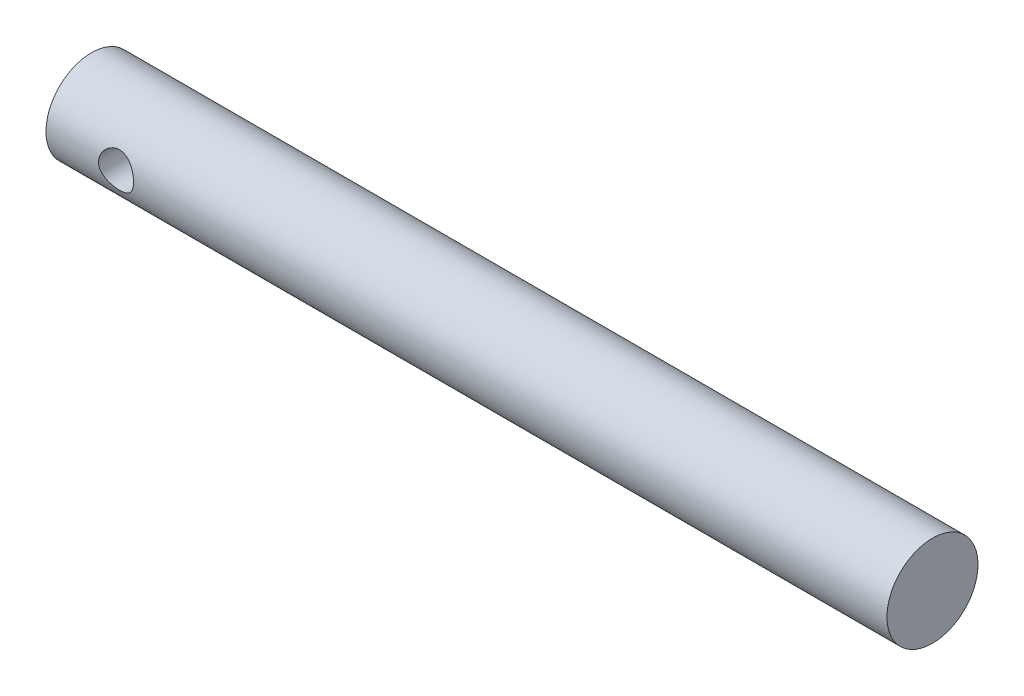
ISO-10303-21;
HEADER;
FILE_DESCRIPTION(('STEP AP214'),'2;1');
FILE_NAME('part.step','',(''),(''),'','','');
FILE_SCHEMA(('AUTOMOTIVE_DESIGN { 1 0 10303 214 1 1 1 1 }'));
ENDSEC;
DATA;
#1=APPLICATION_CONTEXT('core data for automotive mechanical design processes');
#2=APPLICATION_PROTOCOL_DEFINITION('international standard','automotive_design',2000,#1);
#3=PRODUCT_CONTEXT('',#1,'mechanical');
#4=PRODUCT('Part','Part','',(#3));
#5=PRODUCT_RELATED_PRODUCT_CATEGORY('part','',(#4));
#6=PRODUCT_DEFINITION_FORMATION('','',#4);
#7=PRODUCT_DEFINITION_CONTEXT('part definition',#1,'design');
#8=PRODUCT_DEFINITION('design','',#6,#7);
#9=PRODUCT_DEFINITION_SHAPE('','',#8);
#10=(LENGTH_UNIT() NAMED_UNIT(*) SI_UNIT(.MILLI.,.METRE.));
#11=(NAMED_UNIT(*) PLANE_ANGLE_UNIT() SI_UNIT($,.RADIAN.));
#12=(NAMED_UNIT(*) SI_UNIT($,.STERADIAN.) SOLID_ANGLE_UNIT());
#13=UNCERTAINTY_MEASURE_WITH_UNIT(LENGTH_MEASURE(1.E-05),#10,'distance_accuracy_value','');
#14=(GEOMETRIC_REPRESENTATION_CONTEXT(3) GLOBAL_UNCERTAINTY_ASSIGNED_CONTEXT((#13)) GLOBAL_UNIT_ASSIGNED_CONTEXT((#10,
#11,#12)) REPRESENTATION_CONTEXT('',''));
#15=CARTESIAN_POINT('',(0.,0.,0.));
#16=DIRECTION('',(0.,0.,1.));
#17=DIRECTION('',(1.,0.,0.));
#18=AXIS2_PLACEMENT_3D('',#15,#16,#17);
#19=CARTESIAN_POINT('',(-18.,0.,0.));
#20=DIRECTION('',(-1.,0.,0.));
#21=DIRECTION('',(0.,-1.,0.));
#22=AXIS2_PLACEMENT_3D('',#19,#20,#21);
#23=PLANE('',#22);
#24=CARTESIAN_POINT('',(-18.,0.,0.));
#25=DIRECTION('',(-1.,0.,0.));
#26=DIRECTION('',(0.,-1.,0.));
#27=AXIS2_PLACEMENT_3D('',#24,#25,#26);
#28=CIRCLE('',#27,1.95);
#29=CARTESIAN_POINT('',(-18.,-1.95,0.));
#30=VERTEX_POINT('',#29);
#31=EDGE_CURVE('E10',#30,#30,#28,.T.);
#32=ORIENTED_EDGE('',*,*,#31,.T.);
#33=EDGE_LOOP('',(#32));
#34=FACE_BOUND('',#33,.T.);
#35=ADVANCED_FACE('F39',(#34),#23,.T.);
#36=CARTESIAN_POINT('',(-18.,0.,0.));
#37=DIRECTION('',(-1.,0.,0.));
#38=DIRECTION('',(0.,-1.,0.));
#39=AXIS2_PLACEMENT_3D('',#36,#37,#38);
#40=CYLINDRICAL_SURFACE('',#39,1.95);
#41=CARTESIAN_POINT('',(-14.25,0.,-1.95));
#42=CARTESIAN_POINT('',(-14.2499981782097,-0.0405429191923411,-1.9500013889589));
#43=CARTESIAN_POINT('',(-14.2532976030997,-0.0810737051070533,-1.94872476548912));
#44=CARTESIAN_POINT('',(-14.2663514039077,-0.160919968102906,-1.94376018150422));
#45=CARTESIAN_POINT('',(-14.2761044877655,-0.200235686798799,-1.94007270365798));
#46=CARTESIAN_POINT('',(-14.3016669279473,-0.27648840096756,-1.93068098797991));
#47=CARTESIAN_POINT('',(-14.3174642320862,-0.313429960395832,-1.9249807652981));
#48=CARTESIAN_POINT('',(-14.3546037260167,-0.384134726703963,-1.91212797807933));
#49=CARTESIAN_POINT('',(-14.3759474807601,-0.417897032876909,-1.90497500376771));
#50=CARTESIAN_POINT('',(-14.4245608714511,-0.482781776023632,-1.88959736394845));
#51=CARTESIAN_POINT('',(-14.4520332184991,-0.513744818913309,-1.88134129617782));
#52=CARTESIAN_POINT('',(-14.5116936266424,-0.570754120237587,-1.86483836479127));
#53=CARTESIAN_POINT('',(-14.5438832359471,-0.596798758000071,-1.85659150509628));
#54=CARTESIAN_POINT('',(-14.6136524937566,-0.644272025035922,-1.84067024000969));
#55=CARTESIAN_POINT('',(-14.651397638578,-0.665470989304325,-1.83303254536538));
#56=CARTESIAN_POINT('',(-14.7302569979466,-0.701148567532011,-1.81968575562311));
#57=CARTESIAN_POINT('',(-14.7713697784423,-0.715630024704995,-1.81397584486139));
#58=CARTESIAN_POINT('',(-14.8539590208678,-0.73682478870611,-1.80546819243754));
#59=CARTESIAN_POINT('',(-14.8953449859923,-0.743843403602975,-1.80255650754391));
#60=CARTESIAN_POINT('',(-14.9788018379931,-0.75086759842558,-1.79964268449158));
#61=CARTESIAN_POINT('',(-15.020872414606,-0.750876271327548,-1.79963926312822));
#62=CARTESIAN_POINT('',(-15.1016592774455,-0.74411296893883,-1.80244451272089));
#63=CARTESIAN_POINT('',(-15.1404189638744,-0.737771387119336,-1.80507468879926));
#64=CARTESIAN_POINT('',(-15.216274523822,-0.719201418400302,-1.81255302114849));
#65=CARTESIAN_POINT('',(-15.2533701322616,-0.706972097228779,-1.81740152942031));
#66=CARTESIAN_POINT('',(-15.3256974935347,-0.676747991768704,-1.82887311050732));
#67=CARTESIAN_POINT('',(-15.3608787456651,-0.65864535142996,-1.83552896758488));
#68=CARTESIAN_POINT('',(-15.4278263635505,-0.61726383480847,-1.84985510301363));
#69=CARTESIAN_POINT('',(-15.4595915022369,-0.593983107707848,-1.85752574368349));
#70=CARTESIAN_POINT('',(-15.5211777483737,-0.540961545998799,-1.87368103554139));
#71=CARTESIAN_POINT('',(-15.550700765883,-0.51087943334821,-1.88218481651937));
#72=CARTESIAN_POINT('',(-15.604374200785,-0.44609591713673,-1.89858206047745));
#73=CARTESIAN_POINT('',(-15.6285237045002,-0.411393729608995,-1.9064754195167));
#74=CARTESIAN_POINT('',(-15.6711165144645,-0.337562732265242,-1.92093422019693));
#75=CARTESIAN_POINT('',(-15.689455697278,-0.298368629746978,-1.92747477209834));
#76=CARTESIAN_POINT('',(-15.7191798307647,-0.217136899924052,-1.938305104308));
#77=CARTESIAN_POINT('',(-15.7305680373392,-0.17510061418949,-1.94259593827185));
#78=CARTESIAN_POINT('',(-15.7454826545287,-0.0918827622127077,-1.94825556937513));
#79=CARTESIAN_POINT('',(-15.7494101636875,-0.0507831531761167,-1.9497732661453));
#80=CARTESIAN_POINT('',(-15.750466031411,0.0315114168209008,-1.95017911828569));
#81=CARTESIAN_POINT('',(-15.7475959916316,0.0727063530351842,-1.94906789308931));
#82=CARTESIAN_POINT('',(-15.7354394746979,0.152257017445377,-1.94443875795888));
#83=CARTESIAN_POINT('',(-15.7264199081906,0.190659983589788,-1.94102101913293));
#84=CARTESIAN_POINT('',(-15.7025762308496,0.265377333725863,-1.93222438564929));
#85=CARTESIAN_POINT('',(-15.6877513672287,0.301691446150019,-1.92684523665693));
#86=CARTESIAN_POINT('',(-15.65223971543,0.372419288182055,-1.91445348861844));
#87=CARTESIAN_POINT('',(-15.6313908556867,0.406743687293187,-1.90739684429773));
#88=CARTESIAN_POINT('',(-15.5846048615618,0.471524162838171,-1.89242493900216));
#89=CARTESIAN_POINT('',(-15.558665782813,0.501978753731921,-1.88450935044501));
#90=CARTESIAN_POINT('',(-15.500574074795,0.560102599037685,-1.86808794698959));
#91=CARTESIAN_POINT('',(-15.4681387383092,0.587488199711815,-1.85957560686036));
#92=CARTESIAN_POINT('',(-15.3989713792074,0.636488942269692,-1.84337996356592));
#93=CARTESIAN_POINT('',(-15.3622388585389,0.658103414313084,-1.83569675669773));
#94=CARTESIAN_POINT('',(-15.2851271857809,0.69501049765783,-1.8220460966134));
#95=CARTESIAN_POINT('',(-15.2447271482296,0.710263725217771,-1.81608939981491));
#96=CARTESIAN_POINT('',(-15.161636818349,0.733643588359655,-1.80677295827016));
#97=CARTESIAN_POINT('',(-15.118948064502,0.741774949094469,-1.80341149183927));
#98=CARTESIAN_POINT('',(-15.0355834197395,0.75024663159884,-1.79990250805838));
#99=CARTESIAN_POINT('',(-14.9949650942791,0.751073888829789,-1.79955415294045));
#100=CARTESIAN_POINT('',(-14.9141996722696,0.746173238556251,-1.80159164243551));
#101=CARTESIAN_POINT('',(-14.8740525264637,0.740446022530951,-1.8039771986283));
#102=CARTESIAN_POINT('',(-14.7967511811592,0.722985410225056,-1.81104267682804));
#103=CARTESIAN_POINT('',(-14.7595416893064,0.711461485190331,-1.81564235489165));
#104=CARTESIAN_POINT('',(-14.6875650619622,0.682923345478795,-1.82656726894715));
#105=CARTESIAN_POINT('',(-14.6527985612545,0.665907710219587,-1.83289295135217));
#106=CARTESIAN_POINT('',(-14.5846394089277,0.625797958515307,-1.84698443494313));
#107=CARTESIAN_POINT('',(-14.5514240275573,0.602423818284046,-1.85480980698614));
#108=CARTESIAN_POINT('',(-14.4892320846273,0.550684721970976,-1.87082311830124));
#109=CARTESIAN_POINT('',(-14.4602569108256,0.522318138596515,-1.87901117513766));
#110=CARTESIAN_POINT('',(-14.4056473872093,0.459431490657048,-1.89539881550091));
#111=CARTESIAN_POINT('',(-14.3803049823181,0.424649648805944,-1.90357142425467));
#112=CARTESIAN_POINT('',(-14.3358267421072,0.351032148711189,-1.91851148284898));
#113=CARTESIAN_POINT('',(-14.3166919486528,0.312195811418455,-1.9252786967441));
#114=CARTESIAN_POINT('',(-14.2842886742944,0.228870252669729,-1.93700741831298));
#115=CARTESIAN_POINT('',(-14.2714846871835,0.184177511259415,-1.94182221166289));
#116=CARTESIAN_POINT('',(-14.2543438185226,0.0929838293532701,-1.94831680873259));
#117=CARTESIAN_POINT('',(-14.2500020887492,0.0464839398001029,-1.94999840750782));
#118=CARTESIAN_POINT('',(-14.25,0.,-1.95));
#119=B_SPLINE_CURVE_WITH_KNOTS('',3,(#41,#42,#43,#44,#45,#46,#47,#48,#49,#50,#51,#52,#53,#54,
#55,#56,#57,#58,#59,#60,#61,#62,#63,#64,#65,#66,#67,#68,#69,#70,#71,#72,#73,#74,#75,#76,#77,#78,
#79,#80,#81,#82,#83,#84,#85,#86,#87,#88,#89,#90,#91,#92,#93,#94,#95,#96,#97,#98,#99,#100,#101,
#102,#103,#104,#105,#106,#107,#108,#109,#110,#111,#112,#113,#114,#115,#116,#117,#118),
.UNSPECIFIED.,.T.,.F.,(4,2,2,2,2,2,2,2,2,2,2,2,2,2,2,2,2,2,2,2,2,2,2,2,2,2,2,2,2,2,2,2,2,2,2,2,
2,2,4),(0.,0.121457218701953,0.24289012831358,0.364082151895032,0.485308407455807,
0.611378709908598,0.737490481793604,0.8687097231382,0.999873374585367,1.12543609823519,
1.25094342018099,1.36848366926547,1.48604257589701,1.60589565334463,1.72579163925049,
1.85419904496568,1.98262826759134,2.11324351920223,2.24379754238027,2.36710883693884,
2.49039107946488,2.60863705924401,2.72689837735151,2.84869698288168,2.9705422040497,
3.09982797856256,3.22912875243276,3.35921857744994,3.48922202610224,3.61048734931736,
3.73173988054834,3.84889560575541,3.96608166084621,4.08963459462096,4.21322787545637,
4.34400255536972,4.47479917274035,4.61413416828711,4.75338931209274),.UNSPECIFIED.);
#120=CARTESIAN_POINT('',(-14.25,0.,-1.95));
#121=VERTEX_POINT('',#120);
#122=EDGE_CURVE('E51',#121,#121,#119,.T.);
#123=ORIENTED_EDGE('',*,*,#122,.F.);
#124=EDGE_LOOP('',(#123));
#125=FACE_BOUND('',#124,.T.);
#126=CARTESIAN_POINT('',(-14.25,0.,1.95));
#127=CARTESIAN_POINT('',(-14.2499981782097,0.0405429191923415,1.9500013889589));
#128=CARTESIAN_POINT('',(-14.2532976030997,0.0810737051070537,1.94872476548912));
#129=CARTESIAN_POINT('',(-14.2663514039077,0.160919968102907,1.94376018150422));
#130=CARTESIAN_POINT('',(-14.2761044877655,0.2002356867988,1.94007270365798));
#131=CARTESIAN_POINT('',(-14.3016669279473,0.276488400967561,1.93068098797991));
#132=CARTESIAN_POINT('',(-14.3174642320862,0.313429960395832,1.9249807652981));
#133=CARTESIAN_POINT('',(-14.3546037260167,0.384134726703963,1.91212797807933));
#134=CARTESIAN_POINT('',(-14.3759474807601,0.417897032876909,1.90497500376771));
#135=CARTESIAN_POINT('',(-14.4245608714511,0.482781776023632,1.88959736394845));
#136=CARTESIAN_POINT('',(-14.4520332184991,0.51374481891331,1.88134129617782));
#137=CARTESIAN_POINT('',(-14.5116936266424,0.570754120237587,1.86483836479127));
#138=CARTESIAN_POINT('',(-14.5438832359471,0.596798758000071,1.85659150509628));
#139=CARTESIAN_POINT('',(-14.6136524937566,0.644272025035922,1.84067024000969));
#140=CARTESIAN_POINT('',(-14.651397638578,0.665470989304324,1.83303254536538));
#141=CARTESIAN_POINT('',(-14.7302569979466,0.70114856753201,1.81968575562311));
#142=CARTESIAN_POINT('',(-14.7713697784423,0.715630024704995,1.81397584486139));
#143=CARTESIAN_POINT('',(-14.8539590208678,0.73682478870611,1.80546819243754));
#144=CARTESIAN_POINT('',(-14.8953449859923,0.743843403602975,1.80255650754391));
#145=CARTESIAN_POINT('',(-14.9788018379931,0.75086759842558,1.79964268449158));
#146=CARTESIAN_POINT('',(-15.020872414606,0.750876271327548,1.79963926312822));
#147=CARTESIAN_POINT('',(-15.1016592774455,0.74411296893883,1.80244451272089));
#148=CARTESIAN_POINT('',(-15.1404189638744,0.737771387119336,1.80507468879926));
#149=CARTESIAN_POINT('',(-15.216274523822,0.719201418400302,1.81255302114849));
#150=CARTESIAN_POINT('',(-15.2533701322616,0.706972097228779,1.81740152942031));
#151=CARTESIAN_POINT('',(-15.3256974935347,0.676747991768704,1.82887311050732));
#152=CARTESIAN_POINT('',(-15.3608787456651,0.65864535142996,1.83552896758488));
#153=CARTESIAN_POINT('',(-15.4278263635505,0.617263834808469,1.84985510301363));
#154=CARTESIAN_POINT('',(-15.4595915022369,0.593983107707847,1.85752574368349));
#155=CARTESIAN_POINT('',(-15.5211777483737,0.540961545998798,1.87368103554139));
#156=CARTESIAN_POINT('',(-15.550700765883,0.510879433348209,1.88218481651938));
#157=CARTESIAN_POINT('',(-15.604374200785,0.446095917136729,1.89858206047745));
#158=CARTESIAN_POINT('',(-15.6285237045002,0.411393729608994,1.9064754195167));
#159=CARTESIAN_POINT('',(-15.6711165144645,0.337562732265242,1.92093422019693));
#160=CARTESIAN_POINT('',(-15.689455697278,0.298368629746978,1.92747477209834));
#161=CARTESIAN_POINT('',(-15.7191798307647,0.217136899924051,1.938305104308));
#162=CARTESIAN_POINT('',(-15.7305680373392,0.175100614189488,1.94259593827185));
#163=CARTESIAN_POINT('',(-15.7454826545287,0.0918827622127061,1.94825556937513));
#164=CARTESIAN_POINT('',(-15.7494101636875,0.0507831531761153,1.9497732661453));
#165=CARTESIAN_POINT('',(-15.750466031411,-0.031511416820902,1.95017911828569));
#166=CARTESIAN_POINT('',(-15.7475959916316,-0.0727063530351853,1.94906789308931));
#167=CARTESIAN_POINT('',(-15.7354394746979,-0.152257017445378,1.94443875795888));
#168=CARTESIAN_POINT('',(-15.7264199081906,-0.190659983589789,1.94102101913293));
#169=CARTESIAN_POINT('',(-15.7025762308496,-0.265377333725864,1.93222438564929));
#170=CARTESIAN_POINT('',(-15.6877513672287,-0.30169144615002,1.92684523665693));
#171=CARTESIAN_POINT('',(-15.65223971543,-0.372419288182056,1.91445348861844));
#172=CARTESIAN_POINT('',(-15.6313908556867,-0.406743687293187,1.90739684429773));
#173=CARTESIAN_POINT('',(-15.5846048615618,-0.471524162838172,1.89242493900216));
#174=CARTESIAN_POINT('',(-15.558665782813,-0.501978753731922,1.88450935044501));
#175=CARTESIAN_POINT('',(-15.500574074795,-0.560102599037686,1.86808794698959));
#176=CARTESIAN_POINT('',(-15.4681387383092,-0.587488199711815,1.85957560686036));
#177=CARTESIAN_POINT('',(-15.3989713792074,-0.636488942269692,1.84337996356592));
#178=CARTESIAN_POINT('',(-15.3622388585389,-0.658103414313084,1.83569675669773));
#179=CARTESIAN_POINT('',(-15.2851271857809,-0.695010497657831,1.8220460966134));
#180=CARTESIAN_POINT('',(-15.2447271482296,-0.710263725217772,1.81608939981491));
#181=CARTESIAN_POINT('',(-15.161636818349,-0.733643588359656,1.80677295827016));
#182=CARTESIAN_POINT('',(-15.118948064502,-0.741774949094469,1.80341149183927));
#183=CARTESIAN_POINT('',(-15.0355834197395,-0.75024663159884,1.79990250805838));
#184=CARTESIAN_POINT('',(-14.9949650942791,-0.751073888829789,1.79955415294045));
#185=CARTESIAN_POINT('',(-14.9141996722696,-0.746173238556251,1.80159164243551));
#186=CARTESIAN_POINT('',(-14.8740525264637,-0.740446022530951,1.8039771986283));
#187=CARTESIAN_POINT('',(-14.7967511811592,-0.722985410225056,1.81104267682804));
#188=CARTESIAN_POINT('',(-14.7595416893064,-0.711461485190331,1.81564235489165));
#189=CARTESIAN_POINT('',(-14.6875650619622,-0.682923345478795,1.82656726894715));
#190=CARTESIAN_POINT('',(-14.6527985612545,-0.665907710219587,1.83289295135217));
#191=CARTESIAN_POINT('',(-14.5846394089277,-0.625797958515307,1.84698443494313));
#192=CARTESIAN_POINT('',(-14.5514240275573,-0.602423818284046,1.85480980698614));
#193=CARTESIAN_POINT('',(-14.4892320846273,-0.550684721970976,1.87082311830124));
#194=CARTESIAN_POINT('',(-14.4602569108256,-0.522318138596515,1.87901117513766));
#195=CARTESIAN_POINT('',(-14.4056473872093,-0.459431490657048,1.89539881550091));
#196=CARTESIAN_POINT('',(-14.3803049823181,-0.424649648805944,1.90357142425467));
#197=CARTESIAN_POINT('',(-14.3358267421072,-0.351032148711189,1.91851148284897));
#198=CARTESIAN_POINT('',(-14.3166919486528,-0.312195811418455,1.9252786967441));
#199=CARTESIAN_POINT('',(-14.2842886742944,-0.228870252669729,1.93700741831298));
#200=CARTESIAN_POINT('',(-14.2714846871835,-0.184177511259415,1.94182221166289));
#201=CARTESIAN_POINT('',(-14.2543438185226,-0.0929838293532697,1.94831680873259));
#202=CARTESIAN_POINT('',(-14.2500020887492,-0.0464839398001024,1.94999840750782));
#203=CARTESIAN_POINT('',(-14.25,0.,1.95));
#204=B_SPLINE_CURVE_WITH_KNOTS('',3,(#126,#127,#128,#129,#130,#131,#132,#133,#134,#135,#136,
#137,#138,#139,#140,#141,#142,#143,#144,#145,#146,#147,#148,#149,#150,#151,#152,#153,#154,#155,
#156,#157,#158,#159,#160,#161,#162,#163,#164,#165,#166,#167,#168,#169,#170,#171,#172,#173,#174,
#175,#176,#177,#178,#179,#180,#181,#182,#183,#184,#185,#186,#187,#188,#189,#190,#191,#192,#193,
#194,#195,#196,#197,#198,#199,#200,#201,#202,#203),.UNSPECIFIED.,.T.,.F.,(4,2,2,2,2,2,2,2,2,2,2,
2,2,2,2,2,2,2,2,2,2,2,2,2,2,2,2,2,2,2,2,2,2,2,2,2,2,2,4),(0.,0.121457218701953,0.24289012831358,
0.364082151895032,0.485308407455807,0.611378709908598,0.737490481793604,0.868709723138199,
0.999873374585367,1.12543609823519,1.25094342018099,1.36848366926547,1.48604257589701,
1.60589565334463,1.72579163925049,1.85419904496568,1.98262826759134,2.11324351920224,
2.24379754238027,2.36710883693884,2.49039107946488,2.60863705924401,2.72689837735152,
2.84869698288168,2.97054220404971,3.09982797856256,3.22912875243276,3.35921857744995,
3.48922202610224,3.61048734931737,3.73173988054834,3.84889560575541,3.96608166084621,
4.08963459462096,4.21322787545637,4.34400255536972,4.47479917274035,4.61413416828711,
4.75338931209274),.UNSPECIFIED.);
#205=CARTESIAN_POINT('',(-14.25,0.,1.95));
#206=VERTEX_POINT('',#205);
#207=EDGE_CURVE('E56',#206,#206,#204,.T.);
#208=ORIENTED_EDGE('',*,*,#207,.F.);
#209=EDGE_LOOP('',(#208));
#210=FACE_BOUND('',#209,.T.);
#211=CARTESIAN_POINT('',(18.,0.,0.));
#212=DIRECTION('',(-1.,0.,0.));
#213=DIRECTION('',(0.,-1.,0.));
#214=AXIS2_PLACEMENT_3D('',#211,#212,#213);
#215=CIRCLE('',#214,1.95);
#216=CARTESIAN_POINT('',(18.,-1.95,0.));
#217=VERTEX_POINT('',#216);
#218=EDGE_CURVE('E46',#217,#217,#215,.T.);
#219=ORIENTED_EDGE('',*,*,#218,.T.);
#220=EDGE_LOOP('',(#219));
#221=FACE_BOUND('',#220,.T.);
#222=ORIENTED_EDGE('',*,*,#31,.F.);
#223=EDGE_LOOP('',(#222));
#224=FACE_BOUND('',#223,.T.);
#225=ADVANCED_FACE('F66',(#125,#210,#221,#224),#40,.T.);
#226=CARTESIAN_POINT('',(18.,0.,0.));
#227=DIRECTION('',(-1.,0.,0.));
#228=DIRECTION('',(0.,-1.,0.));
#229=AXIS2_PLACEMENT_3D('',#226,#227,#228);
#230=PLANE('',#229);
#231=ORIENTED_EDGE('',*,*,#218,.F.);
#232=EDGE_LOOP('',(#231));
#233=FACE_BOUND('',#232,.T.);
#234=ADVANCED_FACE('F72',(#233),#230,.F.);
#235=CARTESIAN_POINT('',(-15.,0.,-1.95));
#236=DIRECTION('',(0.,0.,1.));
#237=DIRECTION('',(1.,0.,0.));
#238=AXIS2_PLACEMENT_3D('',#235,#236,#237);
#239=CYLINDRICAL_SURFACE('',#238,0.75);
#240=ORIENTED_EDGE('',*,*,#122,.T.);
#241=EDGE_LOOP('',(#240));
#242=FACE_BOUND('',#241,.T.);
#243=ORIENTED_EDGE('',*,*,#207,.T.);
#244=EDGE_LOOP('',(#243));
#245=FACE_BOUND('',#244,.T.);
#246=ADVANCED_FACE('F69',(#242,#245),#239,.F.);
#247=CLOSED_SHELL('',(#35,#225,#234,#246));
#248=MANIFOLD_SOLID_BREP('B2',#247);
#249=ADVANCED_BREP_SHAPE_REPRESENTATION('',(#18,#248),#14);
#250=SHAPE_DEFINITION_REPRESENTATION(#9,#249);
ENDSEC;
END-ISO-10303-21;
